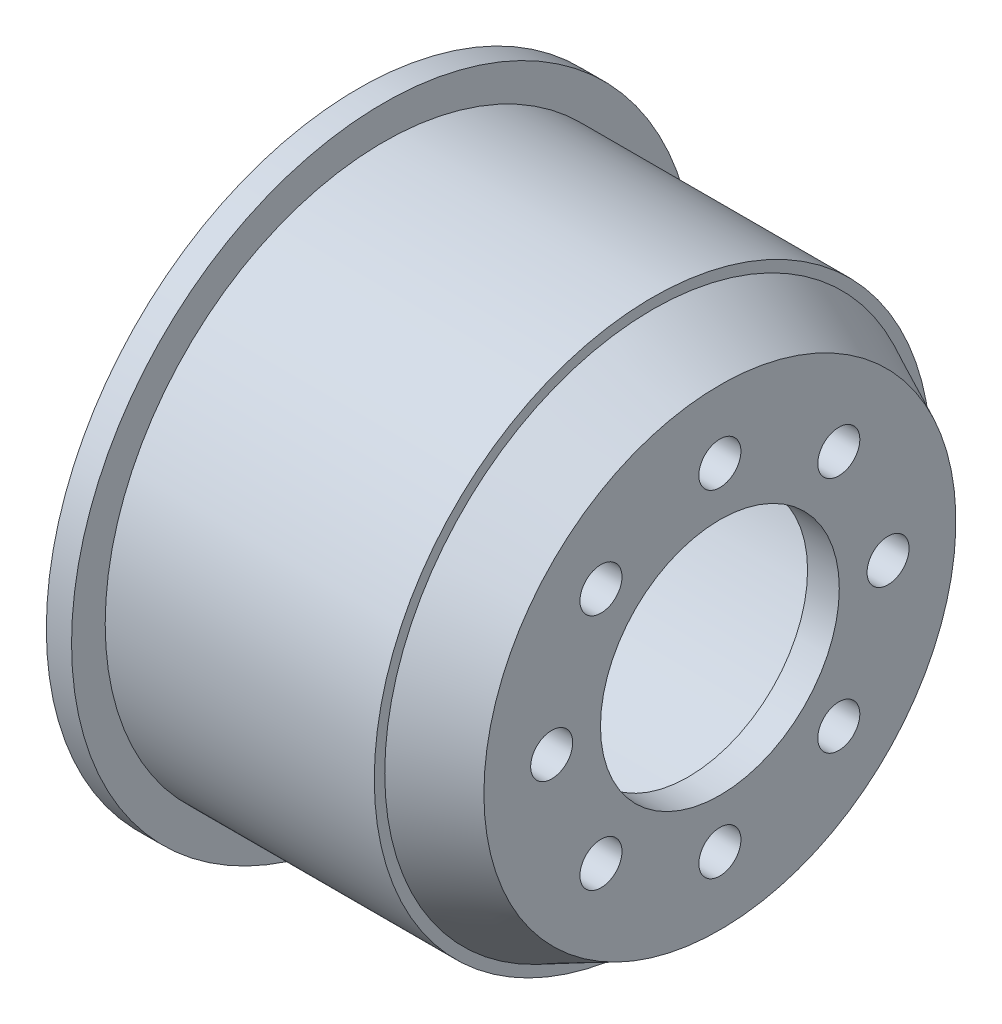
ISO-10303-21;
HEADER;
FILE_DESCRIPTION(('STEP AP214'),'2;1');
FILE_NAME('part.step','',(''),(''),'','','');
FILE_SCHEMA(('AUTOMOTIVE_DESIGN { 1 0 10303 214 1 1 1 1 }'));
ENDSEC;
DATA;
#1=APPLICATION_CONTEXT('core data for automotive mechanical design processes');
#2=APPLICATION_PROTOCOL_DEFINITION('international standard','automotive_design',2000,#1);
#3=PRODUCT_CONTEXT('',#1,'mechanical');
#4=PRODUCT('Part','Part','',(#3));
#5=PRODUCT_RELATED_PRODUCT_CATEGORY('part','',(#4));
#6=PRODUCT_DEFINITION_FORMATION('','',#4);
#7=PRODUCT_DEFINITION_CONTEXT('part definition',#1,'design');
#8=PRODUCT_DEFINITION('design','',#6,#7);
#9=PRODUCT_DEFINITION_SHAPE('','',#8);
#10=(LENGTH_UNIT() NAMED_UNIT(*) SI_UNIT(.MILLI.,.METRE.));
#11=(NAMED_UNIT(*) PLANE_ANGLE_UNIT() SI_UNIT($,.RADIAN.));
#12=(NAMED_UNIT(*) SI_UNIT($,.STERADIAN.) SOLID_ANGLE_UNIT());
#13=UNCERTAINTY_MEASURE_WITH_UNIT(LENGTH_MEASURE(1.E-05),#10,'distance_accuracy_value','');
#14=(GEOMETRIC_REPRESENTATION_CONTEXT(3) GLOBAL_UNCERTAINTY_ASSIGNED_CONTEXT((#13)) GLOBAL_UNIT_ASSIGNED_CONTEXT((#10,
#11,#12)) REPRESENTATION_CONTEXT('',''));
#15=CARTESIAN_POINT('',(0.,0.,0.));
#16=DIRECTION('',(0.,0.,1.));
#17=DIRECTION('',(1.,0.,0.));
#18=AXIS2_PLACEMENT_3D('',#15,#16,#17);
#19=CARTESIAN_POINT('',(-37.2788661687838,0.,0.));
#20=DIRECTION('',(-1.,0.,0.));
#21=DIRECTION('',(0.,0.,1.));
#22=AXIS2_PLACEMENT_3D('',#19,#20,#21);
#23=CYLINDRICAL_SURFACE('',#22,7.1);
#24=CARTESIAN_POINT('',(8.9363056359521,0.,0.));
#25=DIRECTION('',(-1.,0.,0.));
#26=DIRECTION('',(0.,0.,1.));
#27=AXIS2_PLACEMENT_3D('',#24,#25,#26);
#28=CIRCLE('',#27,7.1);
#29=CARTESIAN_POINT('',(8.9363056359521,0.,7.1));
#30=VERTEX_POINT('',#29);
#31=EDGE_CURVE('E10',#30,#30,#28,.T.);
#32=ORIENTED_EDGE('',*,*,#31,.F.);
#33=EDGE_LOOP('',(#32));
#34=FACE_BOUND('',#33,.T.);
#35=CARTESIAN_POINT('',(7.05060691811505,0.,0.));
#36=DIRECTION('',(-1.,0.,0.));
#37=DIRECTION('',(0.,0.,1.));
#38=AXIS2_PLACEMENT_3D('',#35,#36,#37);
#39=CIRCLE('',#38,7.1);
#40=CARTESIAN_POINT('',(7.05060691811505,0.,7.1));
#41=VERTEX_POINT('',#40);
#42=EDGE_CURVE('E43',#41,#41,#39,.T.);
#43=ORIENTED_EDGE('',*,*,#42,.T.);
#44=EDGE_LOOP('',(#43));
#45=FACE_BOUND('',#44,.T.);
#46=ADVANCED_FACE('F37',(#34,#45),#23,.F.);
#47=CARTESIAN_POINT('',(7.05060691811505,0.,-12.7120495428109));
#48=DIRECTION('',(1.,0.,0.));
#49=DIRECTION('',(0.,0.,-1.));
#50=AXIS2_PLACEMENT_3D('',#47,#48,#49);
#51=PLANE('',#50);
#52=CARTESIAN_POINT('',(7.05060691811505,10.,0.));
#53=DIRECTION('',(1.,0.,0.));
#54=DIRECTION('',(0.,0.,-1.));
#55=AXIS2_PLACEMENT_3D('',#52,#53,#54);
#56=CIRCLE('',#55,1.25);
#57=CARTESIAN_POINT('',(7.05060691811505,10.,-1.25));
#58=VERTEX_POINT('',#57);
#59=EDGE_CURVE('E77',#58,#58,#56,.T.);
#60=ORIENTED_EDGE('',*,*,#59,.T.);
#61=EDGE_LOOP('',(#60));
#62=FACE_BOUND('',#61,.T.);
#63=CARTESIAN_POINT('',(7.05060691811505,7.07106781186577,-7.0710678118656));
#64=DIRECTION('',(1.,0.,0.));
#65=DIRECTION('',(0.,0.,-1.));
#66=AXIS2_PLACEMENT_3D('',#63,#64,#65);
#67=CIRCLE('',#66,1.25);
#68=CARTESIAN_POINT('',(7.05060691811505,7.07106781186577,-8.3210678118656));
#69=VERTEX_POINT('',#68);
#70=EDGE_CURVE('E80',#69,#69,#67,.T.);
#71=ORIENTED_EDGE('',*,*,#70,.T.);
#72=EDGE_LOOP('',(#71));
#73=FACE_BOUND('',#72,.T.);
#74=CARTESIAN_POINT('',(7.05060691811505,4.21019224305385E-13,-10.0000000000004));
#75=DIRECTION('',(1.,0.,0.));
#76=DIRECTION('',(0.,0.,-1.));
#77=AXIS2_PLACEMENT_3D('',#74,#75,#76);
#78=CIRCLE('',#77,1.25);
#79=CARTESIAN_POINT('',(7.05060691811505,4.21019224305385E-13,-11.2500000000004));
#80=VERTEX_POINT('',#79);
#81=EDGE_CURVE('E83',#80,#80,#78,.T.);
#82=ORIENTED_EDGE('',*,*,#81,.T.);
#83=EDGE_LOOP('',(#82));
#84=FACE_BOUND('',#83,.T.);
#85=CARTESIAN_POINT('',(7.05060691811505,-7.07106781186518,-7.07106781186619));
#86=DIRECTION('',(1.,0.,0.));
#87=DIRECTION('',(0.,0.,-1.));
#88=AXIS2_PLACEMENT_3D('',#85,#86,#87);
#89=CIRCLE('',#88,1.25);
#90=CARTESIAN_POINT('',(7.05060691811505,-7.07106781186518,-8.32106781186619));
#91=VERTEX_POINT('',#90);
#92=EDGE_CURVE('E86',#91,#91,#89,.T.);
#93=ORIENTED_EDGE('',*,*,#92,.T.);
#94=EDGE_LOOP('',(#93));
#95=FACE_BOUND('',#94,.T.);
#96=CARTESIAN_POINT('',(7.05060691811505,-10.,-8.42038448610771E-13));
#97=DIRECTION('',(1.,0.,0.));
#98=DIRECTION('',(0.,0.,-1.));
#99=AXIS2_PLACEMENT_3D('',#96,#97,#98);
#100=CIRCLE('',#99,1.25);
#101=CARTESIAN_POINT('',(7.05060691811505,-10.,-1.25000000000084));
#102=VERTEX_POINT('',#101);
#103=EDGE_CURVE('E89',#102,#102,#100,.T.);
#104=ORIENTED_EDGE('',*,*,#103,.T.);
#105=EDGE_LOOP('',(#104));
#106=FACE_BOUND('',#105,.T.);
#107=CARTESIAN_POINT('',(7.05060691811505,-7.07106781186577,7.07106781186476));
#108=DIRECTION('',(1.,0.,0.));
#109=DIRECTION('',(0.,0.,-1.));
#110=AXIS2_PLACEMENT_3D('',#107,#108,#109);
#111=CIRCLE('',#110,1.25);
#112=CARTESIAN_POINT('',(7.05060691811505,-7.07106781186577,5.82106781186476));
#113=VERTEX_POINT('',#112);
#114=EDGE_CURVE('E92',#113,#113,#111,.T.);
#115=ORIENTED_EDGE('',*,*,#114,.T.);
#116=EDGE_LOOP('',(#115));
#117=FACE_BOUND('',#116,.T.);
#118=CARTESIAN_POINT('',(7.05060691811505,-4.22243871104533E-13,9.99999999999958));
#119=DIRECTION('',(1.,0.,0.));
#120=DIRECTION('',(0.,0.,-1.));
#121=AXIS2_PLACEMENT_3D('',#118,#119,#120);
#122=CIRCLE('',#121,1.25);
#123=CARTESIAN_POINT('',(7.05060691811505,-4.22243871104533E-13,8.74999999999958));
#124=VERTEX_POINT('',#123);
#125=EDGE_CURVE('E95',#124,#124,#122,.T.);
#126=ORIENTED_EDGE('',*,*,#125,.T.);
#127=EDGE_LOOP('',(#126));
#128=FACE_BOUND('',#127,.T.);
#129=CARTESIAN_POINT('',(7.05060691811505,7.07106781186518,7.07106781186535));
#130=DIRECTION('',(1.,0.,0.));
#131=DIRECTION('',(0.,0.,-1.));
#132=AXIS2_PLACEMENT_3D('',#129,#130,#131);
#133=CIRCLE('',#132,1.25);
#134=CARTESIAN_POINT('',(7.05060691811505,7.07106781186518,5.82106781186535));
#135=VERTEX_POINT('',#134);
#136=EDGE_CURVE('E98',#135,#135,#133,.T.);
#137=ORIENTED_EDGE('',*,*,#136,.T.);
#138=EDGE_LOOP('',(#137));
#139=FACE_BOUND('',#138,.T.);
#140=ORIENTED_EDGE('',*,*,#42,.F.);
#141=EDGE_LOOP('',(#140));
#142=FACE_BOUND('',#141,.T.);
#143=CARTESIAN_POINT('',(7.05060691811505,0.,0.));
#144=DIRECTION('',(-1.,0.,0.));
#145=DIRECTION('',(0.,0.,1.));
#146=AXIS2_PLACEMENT_3D('',#143,#144,#145);
#147=CIRCLE('',#146,12.7120495428109);
#148=CARTESIAN_POINT('',(7.05060691811505,0.,12.7120495428109));
#149=VERTEX_POINT('',#148);
#150=EDGE_CURVE('E47',#149,#149,#147,.T.);
#151=ORIENTED_EDGE('',*,*,#150,.T.);
#152=EDGE_LOOP('',(#151));
#153=FACE_BOUND('',#152,.T.);
#154=ADVANCED_FACE('F163',(#62,#73,#84,#95,#106,#117,#128,#139,#142,#153),#51,.F.);
#155=CARTESIAN_POINT('',(3.17240514474124,0.,0.));
#156=DIRECTION('',(-1.,0.,0.));
#157=DIRECTION('',(0.,0.,1.));
#158=AXIS2_PLACEMENT_3D('',#155,#156,#157);
#159=CONICAL_SURFACE('',#158,14.55,0.442565325993663);
#160=ORIENTED_EDGE('',*,*,#150,.F.);
#161=EDGE_LOOP('',(#160));
#162=FACE_BOUND('',#161,.T.);
#163=CARTESIAN_POINT('',(3.17240514474124,0.,0.));
#164=DIRECTION('',(-1.,0.,0.));
#165=DIRECTION('',(0.,0.,1.));
#166=AXIS2_PLACEMENT_3D('',#163,#164,#165);
#167=CIRCLE('',#166,14.55);
#168=CARTESIAN_POINT('',(3.17240514474124,0.,14.55));
#169=VERTEX_POINT('',#168);
#170=EDGE_CURVE('E51',#169,#169,#167,.T.);
#171=ORIENTED_EDGE('',*,*,#170,.T.);
#172=EDGE_LOOP('',(#171));
#173=FACE_BOUND('',#172,.T.);
#174=ADVANCED_FACE('F168',(#162,#173),#159,.F.);
#175=CARTESIAN_POINT('',(-37.2788661687838,0.,0.));
#176=DIRECTION('',(-1.,0.,0.));
#177=DIRECTION('',(0.,0.,1.));
#178=AXIS2_PLACEMENT_3D('',#175,#176,#177);
#179=CYLINDRICAL_SURFACE('',#178,14.55);
#180=ORIENTED_EDGE('',*,*,#170,.F.);
#181=EDGE_LOOP('',(#180));
#182=FACE_BOUND('',#181,.T.);
#183=CARTESIAN_POINT('',(-12.5636943640479,0.,0.));
#184=DIRECTION('',(-1.,0.,0.));
#185=DIRECTION('',(0.,0.,1.));
#186=AXIS2_PLACEMENT_3D('',#183,#184,#185);
#187=CIRCLE('',#186,14.55);
#188=CARTESIAN_POINT('',(-12.5636943640479,0.,14.55));
#189=VERTEX_POINT('',#188);
#190=EDGE_CURVE('E56',#189,#189,#187,.T.);
#191=ORIENTED_EDGE('',*,*,#190,.T.);
#192=EDGE_LOOP('',(#191));
#193=FACE_BOUND('',#192,.T.);
#194=ADVANCED_FACE('F173',(#182,#193),#179,.F.);
#195=CARTESIAN_POINT('',(-12.5636943640479,0.,-16.55));
#196=DIRECTION('',(1.,0.,0.));
#197=DIRECTION('',(0.,0.,-1.));
#198=AXIS2_PLACEMENT_3D('',#195,#196,#197);
#199=PLANE('',#198);
#200=ORIENTED_EDGE('',*,*,#190,.F.);
#201=EDGE_LOOP('',(#200));
#202=FACE_BOUND('',#201,.T.);
#203=CARTESIAN_POINT('',(-12.5636943640479,0.,0.));
#204=DIRECTION('',(-1.,0.,0.));
#205=DIRECTION('',(0.,0.,1.));
#206=AXIS2_PLACEMENT_3D('',#203,#204,#205);
#207=CIRCLE('',#206,18.55);
#208=CARTESIAN_POINT('',(-12.5636943640479,0.,18.55));
#209=VERTEX_POINT('',#208);
#210=EDGE_CURVE('E59',#209,#209,#207,.T.);
#211=ORIENTED_EDGE('',*,*,#210,.T.);
#212=EDGE_LOOP('',(#211));
#213=FACE_BOUND('',#212,.T.);
#214=ADVANCED_FACE('F180',(#202,#213),#199,.F.);
#215=CARTESIAN_POINT('',(-37.2788661687838,0.,0.));
#216=DIRECTION('',(-1.,0.,0.));
#217=DIRECTION('',(0.,0.,1.));
#218=AXIS2_PLACEMENT_3D('',#215,#216,#217);
#219=CYLINDRICAL_SURFACE('',#218,18.55);
#220=ORIENTED_EDGE('',*,*,#210,.F.);
#221=EDGE_LOOP('',(#220));
#222=FACE_BOUND('',#221,.T.);
#223=CARTESIAN_POINT('',(-11.0636943640479,0.,0.));
#224=DIRECTION('',(-1.,0.,0.));
#225=DIRECTION('',(0.,0.,1.));
#226=AXIS2_PLACEMENT_3D('',#223,#224,#225);
#227=CIRCLE('',#226,18.55);
#228=CARTESIAN_POINT('',(-11.0636943640479,0.,18.55));
#229=VERTEX_POINT('',#228);
#230=EDGE_CURVE('E62',#229,#229,#227,.T.);
#231=ORIENTED_EDGE('',*,*,#230,.T.);
#232=EDGE_LOOP('',(#231));
#233=FACE_BOUND('',#232,.T.);
#234=ADVANCED_FACE('F184',(#222,#233),#219,.T.);
#235=CARTESIAN_POINT('',(-11.0636943640479,0.,-18.55));
#236=DIRECTION('',(-1.,0.,0.));
#237=DIRECTION('',(0.,0.,1.));
#238=AXIS2_PLACEMENT_3D('',#235,#236,#237);
#239=PLANE('',#238);
#240=ORIENTED_EDGE('',*,*,#230,.F.);
#241=EDGE_LOOP('',(#240));
#242=FACE_BOUND('',#241,.T.);
#243=CARTESIAN_POINT('',(-11.0636943640479,0.,0.));
#244=DIRECTION('',(-1.,0.,0.));
#245=DIRECTION('',(0.,0.,1.));
#246=AXIS2_PLACEMENT_3D('',#243,#244,#245);
#247=CIRCLE('',#246,16.55);
#248=CARTESIAN_POINT('',(-11.0636943640479,0.,16.55));
#249=VERTEX_POINT('',#248);
#250=EDGE_CURVE('E65',#249,#249,#247,.T.);
#251=ORIENTED_EDGE('',*,*,#250,.T.);
#252=EDGE_LOOP('',(#251));
#253=FACE_BOUND('',#252,.T.);
#254=ADVANCED_FACE('F188',(#242,#253),#239,.F.);
#255=CARTESIAN_POINT('',(-37.2788661687838,0.,0.));
#256=DIRECTION('',(-1.,0.,0.));
#257=DIRECTION('',(0.,0.,1.));
#258=AXIS2_PLACEMENT_3D('',#255,#256,#257);
#259=CYLINDRICAL_SURFACE('',#258,16.55);
#260=ORIENTED_EDGE('',*,*,#250,.F.);
#261=EDGE_LOOP('',(#260));
#262=FACE_BOUND('',#261,.T.);
#263=CARTESIAN_POINT('',(4.93630563595211,0.,0.));
#264=DIRECTION('',(-1.,0.,0.));
#265=DIRECTION('',(0.,0.,1.));
#266=AXIS2_PLACEMENT_3D('',#263,#264,#265);
#267=CIRCLE('',#266,16.55);
#268=CARTESIAN_POINT('',(4.93630563595211,0.,16.55));
#269=VERTEX_POINT('',#268);
#270=EDGE_CURVE('E68',#269,#269,#267,.T.);
#271=ORIENTED_EDGE('',*,*,#270,.T.);
#272=EDGE_LOOP('',(#271));
#273=FACE_BOUND('',#272,.T.);
#274=ADVANCED_FACE('F158',(#262,#273),#259,.T.);
#275=CARTESIAN_POINT('',(4.9363056359521,0.,-15.9272869797883));
#276=DIRECTION('',(-1.,0.,0.));
#277=DIRECTION('',(0.,0.,1.));
#278=AXIS2_PLACEMENT_3D('',#275,#276,#277);
#279=PLANE('',#278);
#280=ORIENTED_EDGE('',*,*,#270,.F.);
#281=EDGE_LOOP('',(#280));
#282=FACE_BOUND('',#281,.T.);
#283=CARTESIAN_POINT('',(4.93630563595211,0.,0.));
#284=DIRECTION('',(-1.,0.,0.));
#285=DIRECTION('',(0.,0.,1.));
#286=AXIS2_PLACEMENT_3D('',#283,#284,#285);
#287=CIRCLE('',#286,15.9272869797883);
#288=CARTESIAN_POINT('',(4.93630563595211,0.,15.9272869797883));
#289=VERTEX_POINT('',#288);
#290=EDGE_CURVE('E71',#289,#289,#287,.T.);
#291=ORIENTED_EDGE('',*,*,#290,.T.);
#292=EDGE_LOOP('',(#291));
#293=FACE_BOUND('',#292,.T.);
#294=ADVANCED_FACE('F152',(#282,#293),#279,.F.);
#295=CARTESIAN_POINT('',(8.9363056359521,0.,0.));
#296=DIRECTION('',(-1.,0.,0.));
#297=DIRECTION('',(0.,0.,1.));
#298=AXIS2_PLACEMENT_3D('',#295,#296,#297);
#299=CONICAL_SURFACE('',#298,14.0316141245926,0.442565325993663);
#300=ORIENTED_EDGE('',*,*,#290,.F.);
#301=EDGE_LOOP('',(#300));
#302=FACE_BOUND('',#301,.T.);
#303=CARTESIAN_POINT('',(8.9363056359521,0.,0.));
#304=DIRECTION('',(-1.,0.,0.));
#305=DIRECTION('',(0.,0.,1.));
#306=AXIS2_PLACEMENT_3D('',#303,#304,#305);
#307=CIRCLE('',#306,14.0316141245926);
#308=CARTESIAN_POINT('',(8.9363056359521,0.,14.0316141245926));
#309=VERTEX_POINT('',#308);
#310=EDGE_CURVE('E74',#309,#309,#307,.T.);
#311=ORIENTED_EDGE('',*,*,#310,.T.);
#312=EDGE_LOOP('',(#311));
#313=FACE_BOUND('',#312,.T.);
#314=ADVANCED_FACE('F133',(#302,#313),#299,.T.);
#315=CARTESIAN_POINT('',(8.9363056359521,0.,-8.625));
#316=DIRECTION('',(-1.,0.,0.));
#317=DIRECTION('',(0.,0.,1.));
#318=AXIS2_PLACEMENT_3D('',#315,#316,#317);
#319=PLANE('',#318);
#320=CARTESIAN_POINT('',(8.9363056359521,10.,0.));
#321=DIRECTION('',(1.,0.,0.));
#322=DIRECTION('',(0.,0.,-1.));
#323=AXIS2_PLACEMENT_3D('',#320,#321,#322);
#324=CIRCLE('',#323,1.25);
#325=CARTESIAN_POINT('',(8.9363056359521,10.,-1.25));
#326=VERTEX_POINT('',#325);
#327=EDGE_CURVE('E101',#326,#326,#324,.T.);
#328=ORIENTED_EDGE('',*,*,#327,.F.);
#329=EDGE_LOOP('',(#328));
#330=FACE_BOUND('',#329,.T.);
#331=CARTESIAN_POINT('',(8.9363056359521,7.07106781186577,-7.0710678118656));
#332=DIRECTION('',(1.,0.,0.));
#333=DIRECTION('',(0.,0.,-1.));
#334=AXIS2_PLACEMENT_3D('',#331,#332,#333);
#335=CIRCLE('',#334,1.25);
#336=CARTESIAN_POINT('',(8.9363056359521,7.07106781186577,-8.3210678118656));
#337=VERTEX_POINT('',#336);
#338=EDGE_CURVE('E120',#337,#337,#335,.T.);
#339=ORIENTED_EDGE('',*,*,#338,.F.);
#340=EDGE_LOOP('',(#339));
#341=FACE_BOUND('',#340,.T.);
#342=CARTESIAN_POINT('',(8.9363056359521,4.21019224305385E-13,-10.0000000000004));
#343=DIRECTION('',(1.,0.,0.));
#344=DIRECTION('',(0.,0.,-1.));
#345=AXIS2_PLACEMENT_3D('',#342,#343,#344);
#346=CIRCLE('',#345,1.25);
#347=CARTESIAN_POINT('',(8.9363056359521,4.21019224305385E-13,-11.2500000000004));
#348=VERTEX_POINT('',#347);
#349=EDGE_CURVE('E117',#348,#348,#346,.T.);
#350=ORIENTED_EDGE('',*,*,#349,.F.);
#351=EDGE_LOOP('',(#350));
#352=FACE_BOUND('',#351,.T.);
#353=CARTESIAN_POINT('',(8.9363056359521,-7.07106781186518,-7.07106781186619));
#354=DIRECTION('',(1.,0.,0.));
#355=DIRECTION('',(0.,0.,-1.));
#356=AXIS2_PLACEMENT_3D('',#353,#354,#355);
#357=CIRCLE('',#356,1.25);
#358=CARTESIAN_POINT('',(8.9363056359521,-7.07106781186518,-8.32106781186619));
#359=VERTEX_POINT('',#358);
#360=EDGE_CURVE('E114',#359,#359,#357,.T.);
#361=ORIENTED_EDGE('',*,*,#360,.F.);
#362=EDGE_LOOP('',(#361));
#363=FACE_BOUND('',#362,.T.);
#364=CARTESIAN_POINT('',(8.9363056359521,-10.,-8.42038448610771E-13));
#365=DIRECTION('',(1.,0.,0.));
#366=DIRECTION('',(0.,0.,-1.));
#367=AXIS2_PLACEMENT_3D('',#364,#365,#366);
#368=CIRCLE('',#367,1.25);
#369=CARTESIAN_POINT('',(8.9363056359521,-10.,-1.25000000000084));
#370=VERTEX_POINT('',#369);
#371=EDGE_CURVE('E111',#370,#370,#368,.T.);
#372=ORIENTED_EDGE('',*,*,#371,.F.);
#373=EDGE_LOOP('',(#372));
#374=FACE_BOUND('',#373,.T.);
#375=CARTESIAN_POINT('',(8.9363056359521,-7.07106781186577,7.07106781186476));
#376=DIRECTION('',(1.,0.,0.));
#377=DIRECTION('',(0.,0.,-1.));
#378=AXIS2_PLACEMENT_3D('',#375,#376,#377);
#379=CIRCLE('',#378,1.25);
#380=CARTESIAN_POINT('',(8.9363056359521,-7.07106781186577,5.82106781186476));
#381=VERTEX_POINT('',#380);
#382=EDGE_CURVE('E108',#381,#381,#379,.T.);
#383=ORIENTED_EDGE('',*,*,#382,.F.);
#384=EDGE_LOOP('',(#383));
#385=FACE_BOUND('',#384,.T.);
#386=CARTESIAN_POINT('',(8.9363056359521,-4.22243871104533E-13,9.99999999999958));
#387=DIRECTION('',(1.,0.,0.));
#388=DIRECTION('',(0.,0.,-1.));
#389=AXIS2_PLACEMENT_3D('',#386,#387,#388);
#390=CIRCLE('',#389,1.25);
#391=CARTESIAN_POINT('',(8.9363056359521,-4.22243871104533E-13,8.74999999999958));
#392=VERTEX_POINT('',#391);
#393=EDGE_CURVE('E105',#392,#392,#390,.T.);
#394=ORIENTED_EDGE('',*,*,#393,.F.);
#395=EDGE_LOOP('',(#394));
#396=FACE_BOUND('',#395,.T.);
#397=CARTESIAN_POINT('',(8.9363056359521,7.07106781186518,7.07106781186535));
#398=DIRECTION('',(1.,0.,0.));
#399=DIRECTION('',(0.,0.,-1.));
#400=AXIS2_PLACEMENT_3D('',#397,#398,#399);
#401=CIRCLE('',#400,1.25);
#402=CARTESIAN_POINT('',(8.9363056359521,7.07106781186518,5.82106781186535));
#403=VERTEX_POINT('',#402);
#404=EDGE_CURVE('E102',#403,#403,#401,.T.);
#405=ORIENTED_EDGE('',*,*,#404,.F.);
#406=EDGE_LOOP('',(#405));
#407=FACE_BOUND('',#406,.T.);
#408=ORIENTED_EDGE('',*,*,#310,.F.);
#409=EDGE_LOOP('',(#408));
#410=FACE_BOUND('',#409,.T.);
#411=ORIENTED_EDGE('',*,*,#31,.T.);
#412=EDGE_LOOP('',(#411));
#413=FACE_BOUND('',#412,.T.);
#414=ADVANCED_FACE('F129',(#330,#341,#352,#363,#374,#385,#396,#407,#410,#413),#319,.F.);
#415=CARTESIAN_POINT('',(3.9363056359521,7.07106781186518,7.07106781186535));
#416=DIRECTION('',(1.,0.,0.));
#417=DIRECTION('',(0.,0.,-1.));
#418=AXIS2_PLACEMENT_3D('',#415,#416,#417);
#419=CYLINDRICAL_SURFACE('',#418,1.25);
#420=ORIENTED_EDGE('',*,*,#404,.T.);
#421=EDGE_LOOP('',(#420));
#422=FACE_BOUND('',#421,.T.);
#423=ORIENTED_EDGE('',*,*,#136,.F.);
#424=EDGE_LOOP('',(#423));
#425=FACE_BOUND('',#424,.T.);
#426=ADVANCED_FACE('F132',(#422,#425),#419,.F.);
#427=CARTESIAN_POINT('',(3.9363056359521,-4.22243871104533E-13,9.99999999999958));
#428=DIRECTION('',(1.,0.,0.));
#429=DIRECTION('',(0.,0.,-1.));
#430=AXIS2_PLACEMENT_3D('',#427,#428,#429);
#431=CYLINDRICAL_SURFACE('',#430,1.25);
#432=ORIENTED_EDGE('',*,*,#393,.T.);
#433=EDGE_LOOP('',(#432));
#434=FACE_BOUND('',#433,.T.);
#435=ORIENTED_EDGE('',*,*,#125,.F.);
#436=EDGE_LOOP('',(#435));
#437=FACE_BOUND('',#436,.T.);
#438=ADVANCED_FACE('F234',(#434,#437),#431,.F.);
#439=CARTESIAN_POINT('',(3.9363056359521,-7.07106781186577,7.07106781186476));
#440=DIRECTION('',(1.,0.,0.));
#441=DIRECTION('',(0.,0.,-1.));
#442=AXIS2_PLACEMENT_3D('',#439,#440,#441);
#443=CYLINDRICAL_SURFACE('',#442,1.25);
#444=ORIENTED_EDGE('',*,*,#382,.T.);
#445=EDGE_LOOP('',(#444));
#446=FACE_BOUND('',#445,.T.);
#447=ORIENTED_EDGE('',*,*,#114,.F.);
#448=EDGE_LOOP('',(#447));
#449=FACE_BOUND('',#448,.T.);
#450=ADVANCED_FACE('F244',(#446,#449),#443,.F.);
#451=CARTESIAN_POINT('',(3.9363056359521,-10.,-8.42038448610771E-13));
#452=DIRECTION('',(1.,0.,0.));
#453=DIRECTION('',(0.,0.,-1.));
#454=AXIS2_PLACEMENT_3D('',#451,#452,#453);
#455=CYLINDRICAL_SURFACE('',#454,1.25);
#456=ORIENTED_EDGE('',*,*,#371,.T.);
#457=EDGE_LOOP('',(#456));
#458=FACE_BOUND('',#457,.T.);
#459=ORIENTED_EDGE('',*,*,#103,.F.);
#460=EDGE_LOOP('',(#459));
#461=FACE_BOUND('',#460,.T.);
#462=ADVANCED_FACE('F254',(#458,#461),#455,.F.);
#463=CARTESIAN_POINT('',(3.9363056359521,-7.07106781186518,-7.07106781186619));
#464=DIRECTION('',(1.,0.,0.));
#465=DIRECTION('',(0.,0.,-1.));
#466=AXIS2_PLACEMENT_3D('',#463,#464,#465);
#467=CYLINDRICAL_SURFACE('',#466,1.25);
#468=ORIENTED_EDGE('',*,*,#360,.T.);
#469=EDGE_LOOP('',(#468));
#470=FACE_BOUND('',#469,.T.);
#471=ORIENTED_EDGE('',*,*,#92,.F.);
#472=EDGE_LOOP('',(#471));
#473=FACE_BOUND('',#472,.T.);
#474=ADVANCED_FACE('F264',(#470,#473),#467,.F.);
#475=CARTESIAN_POINT('',(3.9363056359521,4.21019224305385E-13,-10.0000000000004));
#476=DIRECTION('',(1.,0.,0.));
#477=DIRECTION('',(0.,0.,-1.));
#478=AXIS2_PLACEMENT_3D('',#475,#476,#477);
#479=CYLINDRICAL_SURFACE('',#478,1.25);
#480=ORIENTED_EDGE('',*,*,#349,.T.);
#481=EDGE_LOOP('',(#480));
#482=FACE_BOUND('',#481,.T.);
#483=ORIENTED_EDGE('',*,*,#81,.F.);
#484=EDGE_LOOP('',(#483));
#485=FACE_BOUND('',#484,.T.);
#486=ADVANCED_FACE('F274',(#482,#485),#479,.F.);
#487=CARTESIAN_POINT('',(3.9363056359521,7.07106781186577,-7.0710678118656));
#488=DIRECTION('',(1.,0.,0.));
#489=DIRECTION('',(0.,0.,-1.));
#490=AXIS2_PLACEMENT_3D('',#487,#488,#489);
#491=CYLINDRICAL_SURFACE('',#490,1.25);
#492=ORIENTED_EDGE('',*,*,#338,.T.);
#493=EDGE_LOOP('',(#492));
#494=FACE_BOUND('',#493,.T.);
#495=ORIENTED_EDGE('',*,*,#70,.F.);
#496=EDGE_LOOP('',(#495));
#497=FACE_BOUND('',#496,.T.);
#498=ADVANCED_FACE('F284',(#494,#497),#491,.F.);
#499=CARTESIAN_POINT('',(3.9363056359521,10.,0.));
#500=DIRECTION('',(1.,0.,0.));
#501=DIRECTION('',(0.,0.,-1.));
#502=AXIS2_PLACEMENT_3D('',#499,#500,#501);
#503=CYLINDRICAL_SURFACE('',#502,1.25);
#504=ORIENTED_EDGE('',*,*,#327,.T.);
#505=EDGE_LOOP('',(#504));
#506=FACE_BOUND('',#505,.T.);
#507=ORIENTED_EDGE('',*,*,#59,.F.);
#508=EDGE_LOOP('',(#507));
#509=FACE_BOUND('',#508,.T.);
#510=ADVANCED_FACE('F126',(#506,#509),#503,.F.);
#511=CLOSED_SHELL('',(#46,#154,#174,#194,#214,#234,#254,#274,#294,#314,#414,#426,#438,#450,#462,
#474,#486,#498,#510));
#512=MANIFOLD_SOLID_BREP('B2',#511);
#513=ADVANCED_BREP_SHAPE_REPRESENTATION('',(#18,#512),#14);
#514=SHAPE_DEFINITION_REPRESENTATION(#9,#513);
ENDSEC;
END-ISO-10303-21;
